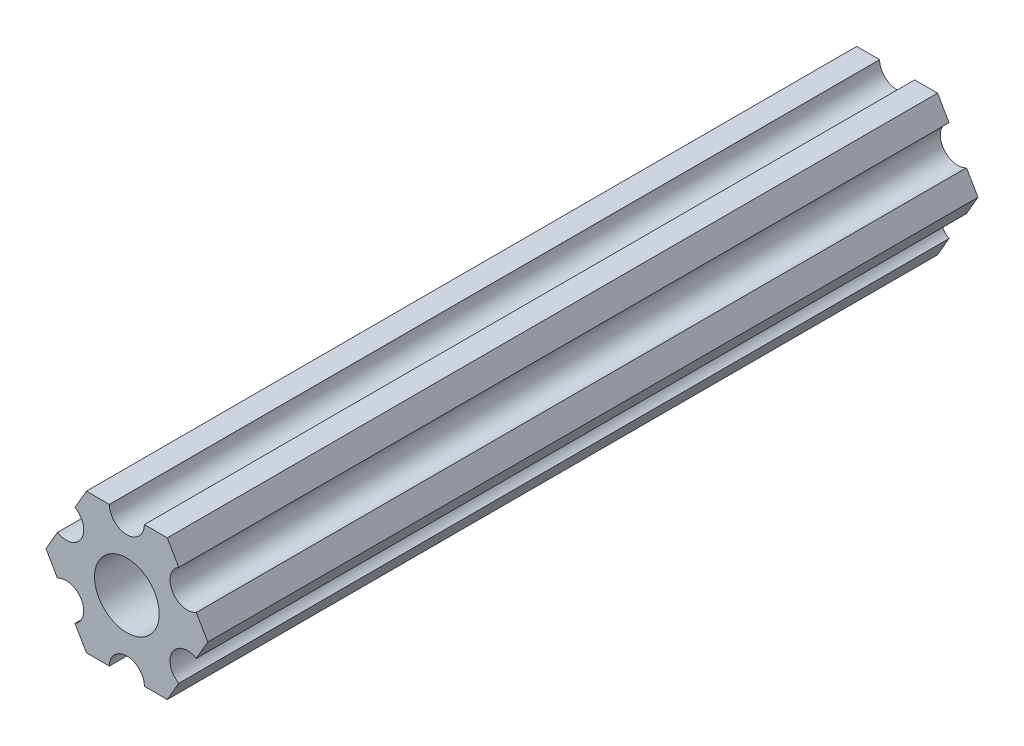
ISO-10303-21;
HEADER;
FILE_DESCRIPTION(('STEP AP214'),'2;1');
FILE_NAME('part.step','',(''),(''),'','','');
FILE_SCHEMA(('AUTOMOTIVE_DESIGN { 1 0 10303 214 1 1 1 1 }'));
ENDSEC;
DATA;
#1=APPLICATION_CONTEXT('core data for automotive mechanical design processes');
#2=APPLICATION_PROTOCOL_DEFINITION('international standard','automotive_design',2000,#1);
#3=PRODUCT_CONTEXT('',#1,'mechanical');
#4=PRODUCT('Part','Part','',(#3));
#5=PRODUCT_RELATED_PRODUCT_CATEGORY('part','',(#4));
#6=PRODUCT_DEFINITION_FORMATION('','',#4);
#7=PRODUCT_DEFINITION_CONTEXT('part definition',#1,'design');
#8=PRODUCT_DEFINITION('design','',#6,#7);
#9=PRODUCT_DEFINITION_SHAPE('','',#8);
#10=(LENGTH_UNIT() NAMED_UNIT(*) SI_UNIT(.MILLI.,.METRE.));
#11=(NAMED_UNIT(*) PLANE_ANGLE_UNIT() SI_UNIT($,.RADIAN.));
#12=(NAMED_UNIT(*) SI_UNIT($,.STERADIAN.) SOLID_ANGLE_UNIT());
#13=UNCERTAINTY_MEASURE_WITH_UNIT(LENGTH_MEASURE(1.E-05),#10,'distance_accuracy_value','');
#14=(GEOMETRIC_REPRESENTATION_CONTEXT(3) GLOBAL_UNCERTAINTY_ASSIGNED_CONTEXT((#13)) GLOBAL_UNIT_ASSIGNED_CONTEXT((#10,
#11,#12)) REPRESENTATION_CONTEXT('',''));
#15=CARTESIAN_POINT('',(0.,0.,0.));
#16=DIRECTION('',(0.,0.,1.));
#17=DIRECTION('',(1.,0.,0.));
#18=AXIS2_PLACEMENT_3D('',#15,#16,#17);
#19=CARTESIAN_POINT('',(5.49926150638083,-3.17499966684068,-69.85));
#20=DIRECTION('',(0.,0.,1.));
#21=DIRECTION('',(1.,0.,0.));
#22=AXIS2_PLACEMENT_3D('',#19,#20,#21);
#23=PLANE('',#22);
#24=CARTESIAN_POINT('',(5.49926150638083,-3.17499966684068,-69.85));
#25=DIRECTION('',(0.,0.,1.));
#26=DIRECTION('',(1.,0.,0.));
#27=AXIS2_PLACEMENT_3D('',#24,#25,#26);
#28=CIRCLE('',#27,1.58750000000001);
#29=CARTESIAN_POINT('',(6.29301142309098,-1.80018429024546,-69.85));
#30=VERTEX_POINT('',#29);
#31=CARTESIAN_POINT('',(4.70551158967068,-4.54981504343589,-69.85));
#32=VERTEX_POINT('',#31);
#33=EDGE_CURVE('E224',#30,#32,#28,.T.);
#34=ORIENTED_EDGE('',*,*,#33,.T.);
#35=DIRECTION('',(-0.499999947533953,-0.866025434075723,0.));
#36=VECTOR('',#35,1.);
#37=CARTESIAN_POINT('',(4.70551158967068,-4.54981504343589,-69.85));
#38=LINE('',#37,#36);
#39=CARTESIAN_POINT('',(3.66617452134693,-6.34999990382519,-69.85));
#40=VERTEX_POINT('',#39);
#41=EDGE_CURVE('E122',#32,#40,#38,.T.);
#42=ORIENTED_EDGE('',*,*,#41,.T.);
#43=DIRECTION('',(-1.,0.,0.));
#44=VECTOR('',#43,1.);
#45=CARTESIAN_POINT('',(3.66617452134693,-6.34999990382519,-69.85));
#46=LINE('',#45,#44);
#47=CARTESIAN_POINT('',(1.58750038469926,-6.34999990382518,-69.85));
#48=VERTEX_POINT('',#47);
#49=EDGE_CURVE('E269',#40,#48,#46,.T.);
#50=ORIENTED_EDGE('',*,*,#49,.T.);
#51=CARTESIAN_POINT('',(3.8469926204343E-07,-6.34999990382519,-69.85));
#52=DIRECTION('',(0.,0.,1.));
#53=DIRECTION('',(1.,0.,0.));
#54=AXIS2_PLACEMENT_3D('',#51,#52,#53);
#55=CIRCLE('',#54,1.5875);
#56=CARTESIAN_POINT('',(-1.58749961530074,-6.34999990382519,-69.85));
#57=VERTEX_POINT('',#56);
#58=EDGE_CURVE('E288',#48,#57,#55,.T.);
#59=ORIENTED_EDGE('',*,*,#58,.T.);
#60=DIRECTION('',(-1.,0.,0.));
#61=VECTOR('',#60,1.);
#62=CARTESIAN_POINT('',(-1.58749961530074,-6.34999990382519,-69.85));
#63=LINE('',#62,#61);
#64=CARTESIAN_POINT('',(-3.66617382465481,-6.34999990382519,-69.85));
#65=VERTEX_POINT('',#64);
#66=EDGE_CURVE('E285',#57,#65,#63,.T.);
#67=ORIENTED_EDGE('',*,*,#66,.T.);
#68=DIRECTION('',(-0.500000006198653,0.866025400205644,0.));
#69=VECTOR('',#68,1.);
#70=CARTESIAN_POINT('',(-3.66617382465481,-6.34999990382519,-69.85));
#71=LINE('',#70,#69);
#72=CARTESIAN_POINT('',(-4.70551094221689,-4.54981523977206,-69.85));
#73=VERTEX_POINT('',#72);
#74=EDGE_CURVE('E287',#65,#73,#71,.T.);
#75=ORIENTED_EDGE('',*,*,#74,.T.);
#76=CARTESIAN_POINT('',(-5.49926095205725,-3.1749999169456,-69.85));
#77=DIRECTION('',(0.,0.,1.));
#78=DIRECTION('',(1.,0.,0.));
#79=AXIS2_PLACEMENT_3D('',#76,#77,#78);
#80=CIRCLE('',#79,1.5875);
#81=CARTESIAN_POINT('',(-6.29301096189761,-1.80018459411914,-69.85));
#82=VERTEX_POINT('',#81);
#83=EDGE_CURVE('E290',#73,#82,#80,.T.);
#84=ORIENTED_EDGE('',*,*,#83,.T.);
#85=DIRECTION('',(-0.500000006198653,0.866025400205645,0.));
#86=VECTOR('',#85,1.);
#87=CARTESIAN_POINT('',(-6.29301096189761,-1.80018459411914,-69.85));
#88=LINE('',#87,#86);
#89=CARTESIAN_POINT('',(-7.33234807945963,6.99338729030344E-08,-69.85));
#90=VERTEX_POINT('',#89);
#91=EDGE_CURVE('E296',#82,#90,#88,.T.);
#92=ORIENTED_EDGE('',*,*,#91,.T.);
#93=DIRECTION('',(0.499999924400249,0.866025447431971,0.));
#94=VECTOR('',#93,1.);
#95=CARTESIAN_POINT('',(-7.33234807945963,6.99338729030344E-08,-69.85));
#96=LINE('',#95,#94);
#97=CARTESIAN_POINT('',(-6.29301121674195,1.80018468525613,-69.85));
#98=VERTEX_POINT('',#97);
#99=EDGE_CURVE('E298',#90,#98,#96,.T.);
#100=ORIENTED_EDGE('',*,*,#99,.T.);
#101=CARTESIAN_POINT('',(-5.49926133675655,3.17500008305439,-69.85));
#102=DIRECTION('',(0.,0.,1.));
#103=DIRECTION('',(1.,0.,0.));
#104=AXIS2_PLACEMENT_3D('',#101,#102,#103);
#105=CIRCLE('',#104,1.5875);
#106=CARTESIAN_POINT('',(-4.70551145677116,4.54981548085265,-69.85));
#107=VERTEX_POINT('',#106);
#108=EDGE_CURVE('E300',#98,#107,#105,.T.);
#109=ORIENTED_EDGE('',*,*,#108,.T.);
#110=DIRECTION('',(0.499999924400249,0.866025447431971,0.));
#111=VECTOR('',#110,1.);
#112=CARTESIAN_POINT('',(-4.70551145677116,4.54981548085265,-69.85));
#113=LINE('',#112,#111);
#114=CARTESIAN_POINT('',(-3.66617452134701,6.35000022210623,-69.85));
#115=VERTEX_POINT('',#114);
#116=EDGE_CURVE('E302',#107,#115,#113,.T.);
#117=ORIENTED_EDGE('',*,*,#116,.T.);
#118=DIRECTION('',(1.,0.,0.));
#119=VECTOR('',#118,1.);
#120=CARTESIAN_POINT('',(-3.66617452134701,6.35000022210623,-69.85));
#121=LINE('',#120,#119);
#122=CARTESIAN_POINT('',(-1.58750038469935,6.35000022210623,-69.85));
#123=VERTEX_POINT('',#122);
#124=EDGE_CURVE('E304',#115,#123,#121,.T.);
#125=ORIENTED_EDGE('',*,*,#124,.T.);
#126=CARTESIAN_POINT('',(-3.84699344941095E-07,6.35000022210623,-69.85));
#127=DIRECTION('',(0.,0.,1.));
#128=DIRECTION('',(1.,0.,0.));
#129=AXIS2_PLACEMENT_3D('',#126,#127,#128);
#130=CIRCLE('',#129,1.5875);
#131=CARTESIAN_POINT('',(1.58749961530066,6.35000022210623,-69.85));
#132=VERTEX_POINT('',#131);
#133=EDGE_CURVE('E306',#123,#132,#130,.T.);
#134=ORIENTED_EDGE('',*,*,#133,.T.);
#135=DIRECTION('',(1.,0.,0.));
#136=VECTOR('',#135,1.);
#137=CARTESIAN_POINT('',(1.58749961530066,6.35000022210623,-69.85));
#138=LINE('',#137,#136);
#139=CARTESIAN_POINT('',(3.66617382465472,6.35000022210622,-69.85));
#140=VERTEX_POINT('',#139);
#141=EDGE_CURVE('E308',#132,#140,#138,.T.);
#142=ORIENTED_EDGE('',*,*,#141,.T.);
#143=DIRECTION('',(0.500000052466056,-0.866025373493145,0.));
#144=VECTOR('',#143,1.);
#145=CARTESIAN_POINT('',(3.66617382465472,6.35000022210622,-69.85));
#146=LINE('',#145,#144);
#147=CARTESIAN_POINT('',(4.70551103839166,4.54981561357968,-69.85));
#148=VERTEX_POINT('',#147);
#149=EDGE_CURVE('E171',#140,#148,#146,.T.);
#150=ORIENTED_EDGE('',*,*,#149,.T.);
#151=CARTESIAN_POINT('',(5.49926112168152,3.17500033315931,-69.85));
#152=DIRECTION('',(0.,0.,1.));
#153=DIRECTION('',(1.,0.,0.));
#154=AXIS2_PLACEMENT_3D('',#151,#152,#153);
#155=CIRCLE('',#154,1.5875);
#156=CARTESIAN_POINT('',(6.29301120497139,1.80018505273895,-69.85));
#157=VERTEX_POINT('',#156);
#158=EDGE_CURVE('E165',#148,#157,#155,.T.);
#159=ORIENTED_EDGE('',*,*,#158,.T.);
#160=DIRECTION('',(0.500000052466056,-0.866025373493145,0.));
#161=VECTOR('',#160,1.);
#162=CARTESIAN_POINT('',(6.29301120497139,1.80018505273895,-69.85));
#163=LINE('',#162,#161);
#164=CARTESIAN_POINT('',(7.33234841870826,4.44212518856872E-07,-69.85));
#165=VERTEX_POINT('',#164);
#166=EDGE_CURVE('E169',#157,#165,#163,.T.);
#167=ORIENTED_EDGE('',*,*,#166,.T.);
#168=DIRECTION('',(-0.499999947533953,-0.866025434075723,0.));
#169=VECTOR('',#168,1.);
#170=CARTESIAN_POINT('',(7.33234841870826,4.44212518856872E-07,-69.85));
#171=LINE('',#170,#169);
#172=EDGE_CURVE('E49',#165,#30,#171,.T.);
#173=ORIENTED_EDGE('',*,*,#172,.T.);
#174=EDGE_LOOP('',(#34,#42,#50,#59,#67,#75,#84,#92,#100,#109,#117,#125,#134,#142,#150,#159,#167,#173));
#175=FACE_BOUND('',#174,.T.);
#176=CARTESIAN_POINT('',(0.,0.,-69.85));
#177=DIRECTION('',(0.,0.,-1.));
#178=DIRECTION('',(1.,0.,0.));
#179=AXIS2_PLACEMENT_3D('',#176,#177,#178);
#180=CIRCLE('',#179,2.9337);
#181=CARTESIAN_POINT('',(2.9337,0.,-69.85));
#182=VERTEX_POINT('',#181);
#183=EDGE_CURVE('E193',#182,#182,#180,.T.);
#184=ORIENTED_EDGE('',*,*,#183,.F.);
#185=EDGE_LOOP('',(#184));
#186=FACE_BOUND('',#185,.T.);
#187=ADVANCED_FACE('F32',(#175,#186),#23,.F.);
#188=CARTESIAN_POINT('',(5.49926150638083,-3.17499966684068,0.));
#189=DIRECTION('',(0.,0.,1.));
#190=DIRECTION('',(1.,0.,0.));
#191=AXIS2_PLACEMENT_3D('',#188,#189,#190);
#192=PLANE('',#191);
#193=CARTESIAN_POINT('',(5.49926150638083,-3.17499966684068,0.));
#194=DIRECTION('',(0.,0.,1.));
#195=DIRECTION('',(1.,0.,0.));
#196=AXIS2_PLACEMENT_3D('',#193,#194,#195);
#197=CIRCLE('',#196,1.58750000000001);
#198=CARTESIAN_POINT('',(6.29301142309098,-1.80018429024546,0.));
#199=VERTEX_POINT('',#198);
#200=CARTESIAN_POINT('',(4.70551158967068,-4.54981504343589,0.));
#201=VERTEX_POINT('',#200);
#202=EDGE_CURVE('E189',#199,#201,#197,.T.);
#203=ORIENTED_EDGE('',*,*,#202,.F.);
#204=DIRECTION('',(-0.499999947533953,-0.866025434075723,0.));
#205=VECTOR('',#204,1.);
#206=CARTESIAN_POINT('',(7.33234841870826,4.44212518856872E-07,0.));
#207=LINE('',#206,#205);
#208=CARTESIAN_POINT('',(7.33234841870826,4.44212518856872E-07,0.));
#209=VERTEX_POINT('',#208);
#210=EDGE_CURVE('E114',#209,#199,#207,.T.);
#211=ORIENTED_EDGE('',*,*,#210,.F.);
#212=DIRECTION('',(0.500000052466056,-0.866025373493145,0.));
#213=VECTOR('',#212,1.);
#214=CARTESIAN_POINT('',(6.29301120497139,1.80018505273895,0.));
#215=LINE('',#214,#213);
#216=CARTESIAN_POINT('',(6.29301120497139,1.80018505273895,0.));
#217=VERTEX_POINT('',#216);
#218=EDGE_CURVE('E108',#217,#209,#215,.T.);
#219=ORIENTED_EDGE('',*,*,#218,.F.);
#220=CARTESIAN_POINT('',(5.49926112168152,3.17500033315931,0.));
#221=DIRECTION('',(0.,0.,1.));
#222=DIRECTION('',(1.,0.,0.));
#223=AXIS2_PLACEMENT_3D('',#220,#221,#222);
#224=CIRCLE('',#223,1.5875);
#225=CARTESIAN_POINT('',(4.70551103839166,4.54981561357968,0.));
#226=VERTEX_POINT('',#225);
#227=EDGE_CURVE('E179',#226,#217,#224,.T.);
#228=ORIENTED_EDGE('',*,*,#227,.F.);
#229=DIRECTION('',(0.500000052466056,-0.866025373493145,0.));
#230=VECTOR('',#229,1.);
#231=CARTESIAN_POINT('',(3.66617382465472,6.35000022210622,0.));
#232=LINE('',#231,#230);
#233=CARTESIAN_POINT('',(3.66617382465472,6.35000022210622,0.));
#234=VERTEX_POINT('',#233);
#235=EDGE_CURVE('E219',#234,#226,#232,.T.);
#236=ORIENTED_EDGE('',*,*,#235,.F.);
#237=DIRECTION('',(1.,0.,0.));
#238=VECTOR('',#237,1.);
#239=CARTESIAN_POINT('',(1.58749961530066,6.35000022210623,0.));
#240=LINE('',#239,#238);
#241=CARTESIAN_POINT('',(1.58749961530066,6.35000022210623,0.));
#242=VERTEX_POINT('',#241);
#243=EDGE_CURVE('E217',#242,#234,#240,.T.);
#244=ORIENTED_EDGE('',*,*,#243,.F.);
#245=CARTESIAN_POINT('',(-3.84699344941095E-07,6.35000022210623,0.));
#246=DIRECTION('',(0.,0.,1.));
#247=DIRECTION('',(1.,0.,0.));
#248=AXIS2_PLACEMENT_3D('',#245,#246,#247);
#249=CIRCLE('',#248,1.5875);
#250=CARTESIAN_POINT('',(-1.58750038469935,6.35000022210623,0.));
#251=VERTEX_POINT('',#250);
#252=EDGE_CURVE('E215',#251,#242,#249,.T.);
#253=ORIENTED_EDGE('',*,*,#252,.F.);
#254=DIRECTION('',(1.,0.,0.));
#255=VECTOR('',#254,1.);
#256=CARTESIAN_POINT('',(-3.66617452134701,6.35000022210623,0.));
#257=LINE('',#256,#255);
#258=CARTESIAN_POINT('',(-3.66617452134701,6.35000022210623,0.));
#259=VERTEX_POINT('',#258);
#260=EDGE_CURVE('E213',#259,#251,#257,.T.);
#261=ORIENTED_EDGE('',*,*,#260,.F.);
#262=DIRECTION('',(0.499999924400249,0.866025447431971,0.));
#263=VECTOR('',#262,1.);
#264=CARTESIAN_POINT('',(-4.70551145677116,4.54981548085265,0.));
#265=LINE('',#264,#263);
#266=CARTESIAN_POINT('',(-4.70551145677116,4.54981548085265,0.));
#267=VERTEX_POINT('',#266);
#268=EDGE_CURVE('E211',#267,#259,#265,.T.);
#269=ORIENTED_EDGE('',*,*,#268,.F.);
#270=CARTESIAN_POINT('',(-5.49926133675655,3.17500008305439,0.));
#271=DIRECTION('',(0.,0.,1.));
#272=DIRECTION('',(1.,0.,0.));
#273=AXIS2_PLACEMENT_3D('',#270,#271,#272);
#274=CIRCLE('',#273,1.5875);
#275=CARTESIAN_POINT('',(-6.29301121674195,1.80018468525613,0.));
#276=VERTEX_POINT('',#275);
#277=EDGE_CURVE('E209',#276,#267,#274,.T.);
#278=ORIENTED_EDGE('',*,*,#277,.F.);
#279=DIRECTION('',(0.499999924400249,0.866025447431971,0.));
#280=VECTOR('',#279,1.);
#281=CARTESIAN_POINT('',(-7.33234807945963,6.99338729030344E-08,0.));
#282=LINE('',#281,#280);
#283=CARTESIAN_POINT('',(-7.33234807945963,6.99338729030344E-08,0.));
#284=VERTEX_POINT('',#283);
#285=EDGE_CURVE('E207',#284,#276,#282,.T.);
#286=ORIENTED_EDGE('',*,*,#285,.F.);
#287=DIRECTION('',(-0.500000006198653,0.866025400205645,0.));
#288=VECTOR('',#287,1.);
#289=CARTESIAN_POINT('',(-6.29301096189761,-1.80018459411914,0.));
#290=LINE('',#289,#288);
#291=CARTESIAN_POINT('',(-6.29301096189761,-1.80018459411914,0.));
#292=VERTEX_POINT('',#291);
#293=EDGE_CURVE('E205',#292,#284,#290,.T.);
#294=ORIENTED_EDGE('',*,*,#293,.F.);
#295=CARTESIAN_POINT('',(-5.49926095205725,-3.1749999169456,0.));
#296=DIRECTION('',(0.,0.,1.));
#297=DIRECTION('',(1.,0.,0.));
#298=AXIS2_PLACEMENT_3D('',#295,#296,#297);
#299=CIRCLE('',#298,1.5875);
#300=CARTESIAN_POINT('',(-4.70551094221689,-4.54981523977206,0.));
#301=VERTEX_POINT('',#300);
#302=EDGE_CURVE('E203',#301,#292,#299,.T.);
#303=ORIENTED_EDGE('',*,*,#302,.F.);
#304=DIRECTION('',(-0.500000006198653,0.866025400205644,0.));
#305=VECTOR('',#304,1.);
#306=CARTESIAN_POINT('',(-3.66617382465481,-6.34999990382519,0.));
#307=LINE('',#306,#305);
#308=CARTESIAN_POINT('',(-3.66617382465481,-6.34999990382519,0.));
#309=VERTEX_POINT('',#308);
#310=EDGE_CURVE('E201',#309,#301,#307,.T.);
#311=ORIENTED_EDGE('',*,*,#310,.F.);
#312=DIRECTION('',(-1.,0.,0.));
#313=VECTOR('',#312,1.);
#314=CARTESIAN_POINT('',(-1.58749961530074,-6.34999990382519,0.));
#315=LINE('',#314,#313);
#316=CARTESIAN_POINT('',(-1.58749961530074,-6.34999990382519,0.));
#317=VERTEX_POINT('',#316);
#318=EDGE_CURVE('E199',#317,#309,#315,.T.);
#319=ORIENTED_EDGE('',*,*,#318,.F.);
#320=CARTESIAN_POINT('',(3.8469926204343E-07,-6.34999990382519,0.));
#321=DIRECTION('',(0.,0.,1.));
#322=DIRECTION('',(1.,0.,0.));
#323=AXIS2_PLACEMENT_3D('',#320,#321,#322);
#324=CIRCLE('',#323,1.5875);
#325=CARTESIAN_POINT('',(1.58750038469926,-6.34999990382518,0.));
#326=VERTEX_POINT('',#325);
#327=EDGE_CURVE('E197',#326,#317,#324,.T.);
#328=ORIENTED_EDGE('',*,*,#327,.F.);
#329=DIRECTION('',(-1.,0.,0.));
#330=VECTOR('',#329,1.);
#331=CARTESIAN_POINT('',(3.66617452134693,-6.34999990382519,0.));
#332=LINE('',#331,#330);
#333=CARTESIAN_POINT('',(3.66617452134693,-6.34999990382519,0.));
#334=VERTEX_POINT('',#333);
#335=EDGE_CURVE('E195',#334,#326,#332,.T.);
#336=ORIENTED_EDGE('',*,*,#335,.F.);
#337=DIRECTION('',(-0.499999947533953,-0.866025434075723,0.));
#338=VECTOR('',#337,1.);
#339=CARTESIAN_POINT('',(4.70551158967068,-4.54981504343589,0.));
#340=LINE('',#339,#338);
#341=EDGE_CURVE('E192',#201,#334,#340,.T.);
#342=ORIENTED_EDGE('',*,*,#341,.F.);
#343=EDGE_LOOP('',(#203,#211,#219,#228,#236,#244,#253,#261,#269,#278,#286,#294,#303,#311,#319,
#328,#336,#342));
#344=FACE_BOUND('',#343,.T.);
#345=CARTESIAN_POINT('',(0.,0.,0.));
#346=DIRECTION('',(0.,0.,-1.));
#347=DIRECTION('',(1.,0.,0.));
#348=AXIS2_PLACEMENT_3D('',#345,#346,#347);
#349=CIRCLE('',#348,2.9337);
#350=CARTESIAN_POINT('',(2.9337,0.,0.));
#351=VERTEX_POINT('',#350);
#352=EDGE_CURVE('E533',#351,#351,#349,.T.);
#353=ORIENTED_EDGE('',*,*,#352,.T.);
#354=EDGE_LOOP('',(#353));
#355=FACE_BOUND('',#354,.T.);
#356=ADVANCED_FACE('F273',(#344,#355),#192,.T.);
#357=CARTESIAN_POINT('',(5.49926150638083,-3.17499966684068,-69.85));
#358=DIRECTION('',(0.,0.,1.));
#359=DIRECTION('',(1.,0.,0.));
#360=AXIS2_PLACEMENT_3D('',#357,#358,#359);
#361=CYLINDRICAL_SURFACE('',#360,1.58750000000001);
#362=ORIENTED_EDGE('',*,*,#202,.T.);
#363=DIRECTION('',(0.,0.,1.));
#364=VECTOR('',#363,1.);
#365=CARTESIAN_POINT('',(4.70551158967068,-4.54981504343589,-69.85));
#366=LINE('',#365,#364);
#367=EDGE_CURVE('E11',#32,#201,#366,.T.);
#368=ORIENTED_EDGE('',*,*,#367,.F.);
#369=ORIENTED_EDGE('',*,*,#33,.F.);
#370=DIRECTION('',(0.,0.,1.));
#371=VECTOR('',#370,1.);
#372=CARTESIAN_POINT('',(6.29301142309098,-1.80018429024546,-69.85));
#373=LINE('',#372,#371);
#374=EDGE_CURVE('E185',#30,#199,#373,.T.);
#375=ORIENTED_EDGE('',*,*,#374,.T.);
#376=EDGE_LOOP('',(#362,#368,#369,#375));
#377=FACE_BOUND('',#376,.T.);
#378=ADVANCED_FACE('F34',(#377),#361,.F.);
#379=CARTESIAN_POINT('',(4.70551158967068,-4.54981504343589,-69.85));
#380=DIRECTION('',(-0.866025434075723,0.499999947533953,0.));
#381=DIRECTION('',(-0.499999947533953,-0.866025434075723,0.));
#382=AXIS2_PLACEMENT_3D('',#379,#380,#381);
#383=PLANE('',#382);
#384=ORIENTED_EDGE('',*,*,#341,.T.);
#385=DIRECTION('',(0.,0.,1.));
#386=VECTOR('',#385,1.);
#387=CARTESIAN_POINT('',(3.66617452134693,-6.34999990382519,-69.85));
#388=LINE('',#387,#386);
#389=EDGE_CURVE('E41',#40,#334,#388,.T.);
#390=ORIENTED_EDGE('',*,*,#389,.F.);
#391=ORIENTED_EDGE('',*,*,#41,.F.);
#392=ORIENTED_EDGE('',*,*,#367,.T.);
#393=EDGE_LOOP('',(#384,#390,#391,#392));
#394=FACE_BOUND('',#393,.T.);
#395=ADVANCED_FACE('F342',(#394),#383,.F.);
#396=CARTESIAN_POINT('',(3.66617452134693,-6.34999990382519,-69.85));
#397=DIRECTION('',(0.,1.,0.));
#398=DIRECTION('',(-1.,0.,0.));
#399=AXIS2_PLACEMENT_3D('',#396,#397,#398);
#400=PLANE('',#399);
#401=ORIENTED_EDGE('',*,*,#335,.T.);
#402=DIRECTION('',(0.,0.,1.));
#403=VECTOR('',#402,1.);
#404=CARTESIAN_POINT('',(1.58750038469926,-6.34999990382518,-69.85));
#405=LINE('',#404,#403);
#406=EDGE_CURVE('E261',#48,#326,#405,.T.);
#407=ORIENTED_EDGE('',*,*,#406,.F.);
#408=ORIENTED_EDGE('',*,*,#49,.F.);
#409=ORIENTED_EDGE('',*,*,#389,.T.);
#410=EDGE_LOOP('',(#401,#407,#408,#409));
#411=FACE_BOUND('',#410,.T.);
#412=ADVANCED_FACE('F267',(#411),#400,.F.);
#413=CARTESIAN_POINT('',(3.8469926204343E-07,-6.34999990382519,-69.85));
#414=DIRECTION('',(0.,0.,1.));
#415=DIRECTION('',(1.,0.,0.));
#416=AXIS2_PLACEMENT_3D('',#413,#414,#415);
#417=CYLINDRICAL_SURFACE('',#416,1.5875);
#418=ORIENTED_EDGE('',*,*,#327,.T.);
#419=DIRECTION('',(0.,0.,1.));
#420=VECTOR('',#419,1.);
#421=CARTESIAN_POINT('',(-1.58749961530074,-6.34999990382519,-69.85));
#422=LINE('',#421,#420);
#423=EDGE_CURVE('E258',#57,#317,#422,.T.);
#424=ORIENTED_EDGE('',*,*,#423,.F.);
#425=ORIENTED_EDGE('',*,*,#58,.F.);
#426=ORIENTED_EDGE('',*,*,#406,.T.);
#427=EDGE_LOOP('',(#418,#424,#425,#426));
#428=FACE_BOUND('',#427,.T.);
#429=ADVANCED_FACE('F279',(#428),#417,.F.);
#430=CARTESIAN_POINT('',(-1.58749961530074,-6.34999990382519,-69.85));
#431=DIRECTION('',(0.,1.,0.));
#432=DIRECTION('',(-1.,0.,0.));
#433=AXIS2_PLACEMENT_3D('',#430,#431,#432);
#434=PLANE('',#433);
#435=ORIENTED_EDGE('',*,*,#318,.T.);
#436=DIRECTION('',(0.,0.,1.));
#437=VECTOR('',#436,1.);
#438=CARTESIAN_POINT('',(-3.66617382465481,-6.34999990382519,-69.85));
#439=LINE('',#438,#437);
#440=EDGE_CURVE('E255',#65,#309,#439,.T.);
#441=ORIENTED_EDGE('',*,*,#440,.F.);
#442=ORIENTED_EDGE('',*,*,#66,.F.);
#443=ORIENTED_EDGE('',*,*,#423,.T.);
#444=EDGE_LOOP('',(#435,#441,#442,#443));
#445=FACE_BOUND('',#444,.T.);
#446=ADVANCED_FACE('F283',(#445),#434,.F.);
#447=CARTESIAN_POINT('',(-3.66617382465481,-6.34999990382519,-69.85));
#448=DIRECTION('',(0.866025400205645,0.500000006198653,0.));
#449=DIRECTION('',(-0.500000006198653,0.866025400205645,0.));
#450=AXIS2_PLACEMENT_3D('',#447,#448,#449);
#451=PLANE('',#450);
#452=ORIENTED_EDGE('',*,*,#310,.T.);
#453=DIRECTION('',(0.,0.,1.));
#454=VECTOR('',#453,1.);
#455=CARTESIAN_POINT('',(-4.70551094221689,-4.54981523977206,-69.85));
#456=LINE('',#455,#454);
#457=EDGE_CURVE('E252',#73,#301,#456,.T.);
#458=ORIENTED_EDGE('',*,*,#457,.F.);
#459=ORIENTED_EDGE('',*,*,#74,.F.);
#460=ORIENTED_EDGE('',*,*,#440,.T.);
#461=EDGE_LOOP('',(#452,#458,#459,#460));
#462=FACE_BOUND('',#461,.T.);
#463=ADVANCED_FACE('F355',(#462),#451,.F.);
#464=CARTESIAN_POINT('',(-5.49926095205725,-3.1749999169456,-69.85));
#465=DIRECTION('',(0.,0.,1.));
#466=DIRECTION('',(1.,0.,0.));
#467=AXIS2_PLACEMENT_3D('',#464,#465,#466);
#468=CYLINDRICAL_SURFACE('',#467,1.5875);
#469=ORIENTED_EDGE('',*,*,#302,.T.);
#470=DIRECTION('',(0.,0.,1.));
#471=VECTOR('',#470,1.);
#472=CARTESIAN_POINT('',(-6.29301096189761,-1.80018459411914,-69.85));
#473=LINE('',#472,#471);
#474=EDGE_CURVE('E249',#82,#292,#473,.T.);
#475=ORIENTED_EDGE('',*,*,#474,.F.);
#476=ORIENTED_EDGE('',*,*,#83,.F.);
#477=ORIENTED_EDGE('',*,*,#457,.T.);
#478=EDGE_LOOP('',(#469,#475,#476,#477));
#479=FACE_BOUND('',#478,.T.);
#480=ADVANCED_FACE('F358',(#479),#468,.F.);
#481=CARTESIAN_POINT('',(-6.29301096189761,-1.80018459411914,-69.85));
#482=DIRECTION('',(0.866025400205645,0.500000006198653,0.));
#483=DIRECTION('',(-0.500000006198653,0.866025400205645,0.));
#484=AXIS2_PLACEMENT_3D('',#481,#482,#483);
#485=PLANE('',#484);
#486=ORIENTED_EDGE('',*,*,#293,.T.);
#487=DIRECTION('',(0.,0.,1.));
#488=VECTOR('',#487,1.);
#489=CARTESIAN_POINT('',(-7.33234807945963,6.99338729030344E-08,-69.85));
#490=LINE('',#489,#488);
#491=EDGE_CURVE('E246',#90,#284,#490,.T.);
#492=ORIENTED_EDGE('',*,*,#491,.F.);
#493=ORIENTED_EDGE('',*,*,#91,.F.);
#494=ORIENTED_EDGE('',*,*,#474,.T.);
#495=EDGE_LOOP('',(#486,#492,#493,#494));
#496=FACE_BOUND('',#495,.T.);
#497=ADVANCED_FACE('F362',(#496),#485,.F.);
#498=CARTESIAN_POINT('',(-7.33234807945963,6.99338729030344E-08,-69.85));
#499=DIRECTION('',(0.866025447431971,-0.499999924400249,0.));
#500=DIRECTION('',(0.499999924400249,0.866025447431971,0.));
#501=AXIS2_PLACEMENT_3D('',#498,#499,#500);
#502=PLANE('',#501);
#503=ORIENTED_EDGE('',*,*,#285,.T.);
#504=DIRECTION('',(0.,0.,1.));
#505=VECTOR('',#504,1.);
#506=CARTESIAN_POINT('',(-6.29301121674195,1.80018468525613,-69.85));
#507=LINE('',#506,#505);
#508=EDGE_CURVE('E243',#98,#276,#507,.T.);
#509=ORIENTED_EDGE('',*,*,#508,.F.);
#510=ORIENTED_EDGE('',*,*,#99,.F.);
#511=ORIENTED_EDGE('',*,*,#491,.T.);
#512=EDGE_LOOP('',(#503,#509,#510,#511));
#513=FACE_BOUND('',#512,.T.);
#514=ADVANCED_FACE('F366',(#513),#502,.F.);
#515=CARTESIAN_POINT('',(-5.49926133675655,3.17500008305439,-69.85));
#516=DIRECTION('',(0.,0.,1.));
#517=DIRECTION('',(1.,0.,0.));
#518=AXIS2_PLACEMENT_3D('',#515,#516,#517);
#519=CYLINDRICAL_SURFACE('',#518,1.5875);
#520=ORIENTED_EDGE('',*,*,#277,.T.);
#521=DIRECTION('',(0.,0.,1.));
#522=VECTOR('',#521,1.);
#523=CARTESIAN_POINT('',(-4.70551145677116,4.54981548085265,-69.85));
#524=LINE('',#523,#522);
#525=EDGE_CURVE('E240',#107,#267,#524,.T.);
#526=ORIENTED_EDGE('',*,*,#525,.F.);
#527=ORIENTED_EDGE('',*,*,#108,.F.);
#528=ORIENTED_EDGE('',*,*,#508,.T.);
#529=EDGE_LOOP('',(#520,#526,#527,#528));
#530=FACE_BOUND('',#529,.T.);
#531=ADVANCED_FACE('F370',(#530),#519,.F.);
#532=CARTESIAN_POINT('',(-4.70551145677116,4.54981548085265,-69.85));
#533=DIRECTION('',(0.866025447431971,-0.499999924400249,0.));
#534=DIRECTION('',(0.499999924400249,0.866025447431971,0.));
#535=AXIS2_PLACEMENT_3D('',#532,#533,#534);
#536=PLANE('',#535);
#537=ORIENTED_EDGE('',*,*,#268,.T.);
#538=DIRECTION('',(0.,0.,1.));
#539=VECTOR('',#538,1.);
#540=CARTESIAN_POINT('',(-3.66617452134701,6.35000022210623,-69.85));
#541=LINE('',#540,#539);
#542=EDGE_CURVE('E237',#115,#259,#541,.T.);
#543=ORIENTED_EDGE('',*,*,#542,.F.);
#544=ORIENTED_EDGE('',*,*,#116,.F.);
#545=ORIENTED_EDGE('',*,*,#525,.T.);
#546=EDGE_LOOP('',(#537,#543,#544,#545));
#547=FACE_BOUND('',#546,.T.);
#548=ADVANCED_FACE('F374',(#547),#536,.F.);
#549=CARTESIAN_POINT('',(-3.66617452134701,6.35000022210623,-69.85));
#550=DIRECTION('',(0.,-1.,0.));
#551=DIRECTION('',(0.,0.,-1.));
#552=AXIS2_PLACEMENT_3D('',#549,#550,#551);
#553=PLANE('',#552);
#554=ORIENTED_EDGE('',*,*,#260,.T.);
#555=DIRECTION('',(0.,0.,1.));
#556=VECTOR('',#555,1.);
#557=CARTESIAN_POINT('',(-1.58750038469935,6.35000022210623,-69.85));
#558=LINE('',#557,#556);
#559=EDGE_CURVE('E234',#123,#251,#558,.T.);
#560=ORIENTED_EDGE('',*,*,#559,.F.);
#561=ORIENTED_EDGE('',*,*,#124,.F.);
#562=ORIENTED_EDGE('',*,*,#542,.T.);
#563=EDGE_LOOP('',(#554,#560,#561,#562));
#564=FACE_BOUND('',#563,.T.);
#565=ADVANCED_FACE('F378',(#564),#553,.F.);
#566=CARTESIAN_POINT('',(-3.84699344941095E-07,6.35000022210623,-69.85));
#567=DIRECTION('',(0.,0.,1.));
#568=DIRECTION('',(1.,0.,0.));
#569=AXIS2_PLACEMENT_3D('',#566,#567,#568);
#570=CYLINDRICAL_SURFACE('',#569,1.5875);
#571=ORIENTED_EDGE('',*,*,#252,.T.);
#572=DIRECTION('',(0.,0.,1.));
#573=VECTOR('',#572,1.);
#574=CARTESIAN_POINT('',(1.58749961530066,6.35000022210623,-69.85));
#575=LINE('',#574,#573);
#576=EDGE_CURVE('E231',#132,#242,#575,.T.);
#577=ORIENTED_EDGE('',*,*,#576,.F.);
#578=ORIENTED_EDGE('',*,*,#133,.F.);
#579=ORIENTED_EDGE('',*,*,#559,.T.);
#580=EDGE_LOOP('',(#571,#577,#578,#579));
#581=FACE_BOUND('',#580,.T.);
#582=ADVANCED_FACE('F382',(#581),#570,.F.);
#583=CARTESIAN_POINT('',(1.58749961530066,6.35000022210623,-69.85));
#584=DIRECTION('',(0.,-1.,0.));
#585=DIRECTION('',(1.,0.,0.));
#586=AXIS2_PLACEMENT_3D('',#583,#584,#585);
#587=PLANE('',#586);
#588=ORIENTED_EDGE('',*,*,#243,.T.);
#589=DIRECTION('',(0.,0.,1.));
#590=VECTOR('',#589,1.);
#591=CARTESIAN_POINT('',(3.66617382465472,6.35000022210622,-69.85));
#592=LINE('',#591,#590);
#593=EDGE_CURVE('E228',#140,#234,#592,.T.);
#594=ORIENTED_EDGE('',*,*,#593,.F.);
#595=ORIENTED_EDGE('',*,*,#141,.F.);
#596=ORIENTED_EDGE('',*,*,#576,.T.);
#597=EDGE_LOOP('',(#588,#594,#595,#596));
#598=FACE_BOUND('',#597,.T.);
#599=ADVANCED_FACE('F314',(#598),#587,.F.);
#600=CARTESIAN_POINT('',(3.66617382465472,6.35000022210622,-69.85));
#601=DIRECTION('',(-0.866025373493145,-0.500000052466056,0.));
#602=DIRECTION('',(0.500000052466056,-0.866025373493145,0.));
#603=AXIS2_PLACEMENT_3D('',#600,#601,#602);
#604=PLANE('',#603);
#605=ORIENTED_EDGE('',*,*,#235,.T.);
#606=DIRECTION('',(0.,0.,1.));
#607=VECTOR('',#606,1.);
#608=CARTESIAN_POINT('',(4.70551103839166,4.54981561357968,-69.85));
#609=LINE('',#608,#607);
#610=EDGE_CURVE('E180',#148,#226,#609,.T.);
#611=ORIENTED_EDGE('',*,*,#610,.F.);
#612=ORIENTED_EDGE('',*,*,#149,.F.);
#613=ORIENTED_EDGE('',*,*,#593,.T.);
#614=EDGE_LOOP('',(#605,#611,#612,#613));
#615=FACE_BOUND('',#614,.T.);
#616=ADVANCED_FACE('F318',(#615),#604,.F.);
#617=CARTESIAN_POINT('',(5.49926112168152,3.17500033315931,-69.85));
#618=DIRECTION('',(0.,0.,1.));
#619=DIRECTION('',(1.,0.,0.));
#620=AXIS2_PLACEMENT_3D('',#617,#618,#619);
#621=CYLINDRICAL_SURFACE('',#620,1.5875);
#622=ORIENTED_EDGE('',*,*,#227,.T.);
#623=DIRECTION('',(0.,0.,1.));
#624=VECTOR('',#623,1.);
#625=CARTESIAN_POINT('',(6.29301120497139,1.80018505273895,-69.85));
#626=LINE('',#625,#624);
#627=EDGE_CURVE('E176',#157,#217,#626,.T.);
#628=ORIENTED_EDGE('',*,*,#627,.F.);
#629=ORIENTED_EDGE('',*,*,#158,.F.);
#630=ORIENTED_EDGE('',*,*,#610,.T.);
#631=EDGE_LOOP('',(#622,#628,#629,#630));
#632=FACE_BOUND('',#631,.T.);
#633=ADVANCED_FACE('F177',(#632),#621,.F.);
#634=CARTESIAN_POINT('',(6.29301120497139,1.80018505273895,-69.85));
#635=DIRECTION('',(-0.866025373493145,-0.500000052466056,0.));
#636=DIRECTION('',(0.500000052466056,-0.866025373493145,0.));
#637=AXIS2_PLACEMENT_3D('',#634,#635,#636);
#638=PLANE('',#637);
#639=ORIENTED_EDGE('',*,*,#218,.T.);
#640=DIRECTION('',(0.,0.,1.));
#641=VECTOR('',#640,1.);
#642=CARTESIAN_POINT('',(7.33234841870826,4.44212518856872E-07,-69.85));
#643=LINE('',#642,#641);
#644=EDGE_CURVE('E181',#165,#209,#643,.T.);
#645=ORIENTED_EDGE('',*,*,#644,.F.);
#646=ORIENTED_EDGE('',*,*,#166,.F.);
#647=ORIENTED_EDGE('',*,*,#627,.T.);
#648=EDGE_LOOP('',(#639,#645,#646,#647));
#649=FACE_BOUND('',#648,.T.);
#650=ADVANCED_FACE('F183',(#649),#638,.F.);
#651=CARTESIAN_POINT('',(7.33234841870826,4.44212518856872E-07,-69.85));
#652=DIRECTION('',(-0.866025434075723,0.499999947533953,0.));
#653=DIRECTION('',(-0.499999947533953,-0.866025434075723,0.));
#654=AXIS2_PLACEMENT_3D('',#651,#652,#653);
#655=PLANE('',#654);
#656=ORIENTED_EDGE('',*,*,#210,.T.);
#657=ORIENTED_EDGE('',*,*,#374,.F.);
#658=ORIENTED_EDGE('',*,*,#172,.F.);
#659=ORIENTED_EDGE('',*,*,#644,.T.);
#660=EDGE_LOOP('',(#656,#657,#658,#659));
#661=FACE_BOUND('',#660,.T.);
#662=ADVANCED_FACE('F322',(#661),#655,.F.);
#663=CARTESIAN_POINT('',(0.,0.,-69.85));
#664=DIRECTION('',(0.,0.,1.));
#665=DIRECTION('',(1.,0.,0.));
#666=AXIS2_PLACEMENT_3D('',#663,#664,#665);
#667=CYLINDRICAL_SURFACE('',#666,2.9337);
#668=ORIENTED_EDGE('',*,*,#183,.T.);
#669=EDGE_LOOP('',(#668));
#670=FACE_BOUND('',#669,.T.);
#671=ORIENTED_EDGE('',*,*,#352,.F.);
#672=EDGE_LOOP('',(#671));
#673=FACE_BOUND('',#672,.T.);
#674=ADVANCED_FACE('F324',(#670,#673),#667,.F.);
#675=CLOSED_SHELL('',(#187,#356,#378,#395,#412,#429,#446,#463,#480,#497,#514,#531,#548,#565,
#582,#599,#616,#633,#650,#662,#674));
#676=MANIFOLD_SOLID_BREP('B2',#675);
#677=ADVANCED_BREP_SHAPE_REPRESENTATION('',(#18,#676),#14);
#678=SHAPE_DEFINITION_REPRESENTATION(#9,#677);
ENDSEC;
END-ISO-10303-21;
